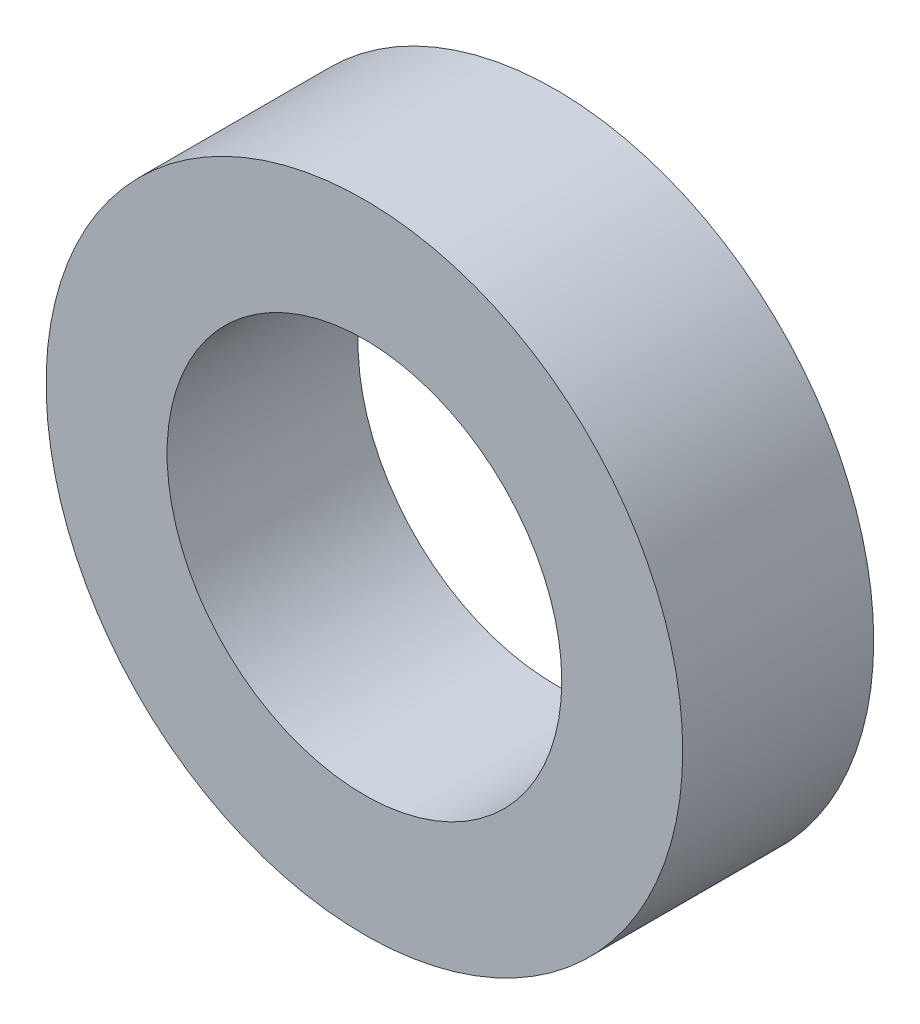
ISO-10303-21;
HEADER;
FILE_DESCRIPTION(('STEP AP214'),'2;1');
FILE_NAME('part.step','',(''),(''),'','','');
FILE_SCHEMA(('AUTOMOTIVE_DESIGN { 1 0 10303 214 1 1 1 1 }'));
ENDSEC;
DATA;
#1=APPLICATION_CONTEXT('core data for automotive mechanical design processes');
#2=APPLICATION_PROTOCOL_DEFINITION('international standard','automotive_design',2000,#1);
#3=PRODUCT_CONTEXT('',#1,'mechanical');
#4=PRODUCT('Part','Part','',(#3));
#5=PRODUCT_RELATED_PRODUCT_CATEGORY('part','',(#4));
#6=PRODUCT_DEFINITION_FORMATION('','',#4);
#7=PRODUCT_DEFINITION_CONTEXT('part definition',#1,'design');
#8=PRODUCT_DEFINITION('design','',#6,#7);
#9=PRODUCT_DEFINITION_SHAPE('','',#8);
#10=(LENGTH_UNIT() NAMED_UNIT(*) SI_UNIT(.MILLI.,.METRE.));
#11=(NAMED_UNIT(*) PLANE_ANGLE_UNIT() SI_UNIT($,.RADIAN.));
#12=(NAMED_UNIT(*) SI_UNIT($,.STERADIAN.) SOLID_ANGLE_UNIT());
#13=UNCERTAINTY_MEASURE_WITH_UNIT(LENGTH_MEASURE(1.E-05),#10,'distance_accuracy_value','');
#14=(GEOMETRIC_REPRESENTATION_CONTEXT(3) GLOBAL_UNCERTAINTY_ASSIGNED_CONTEXT((#13)) GLOBAL_UNIT_ASSIGNED_CONTEXT((#10,
#11,#12)) REPRESENTATION_CONTEXT('',''));
#15=CARTESIAN_POINT('',(0.,0.,0.));
#16=DIRECTION('',(0.,0.,1.));
#17=DIRECTION('',(1.,0.,0.));
#18=AXIS2_PLACEMENT_3D('',#15,#16,#17);
#19=CARTESIAN_POINT('',(0.,0.,3.));
#20=DIRECTION('',(0.,0.,1.));
#21=DIRECTION('',(1.,0.,0.));
#22=AXIS2_PLACEMENT_3D('',#19,#20,#21);
#23=PLANE('',#22);
#24=CARTESIAN_POINT('',(0.,0.,3.));
#25=DIRECTION('',(0.,0.,1.));
#26=DIRECTION('',(1.,0.,0.));
#27=AXIS2_PLACEMENT_3D('',#24,#25,#26);
#28=CIRCLE('',#27,5.);
#29=CARTESIAN_POINT('',(5.,0.,3.));
#30=VERTEX_POINT('',#29);
#31=EDGE_CURVE('E10',#30,#30,#28,.T.);
#32=ORIENTED_EDGE('',*,*,#31,.T.);
#33=EDGE_LOOP('',(#32));
#34=FACE_BOUND('',#33,.T.);
#35=CARTESIAN_POINT('',(0.,0.,3.));
#36=DIRECTION('',(0.,0.,1.));
#37=DIRECTION('',(1.,0.,0.));
#38=AXIS2_PLACEMENT_3D('',#35,#36,#37);
#39=CIRCLE('',#38,3.1);
#40=CARTESIAN_POINT('',(3.1,0.,3.));
#41=VERTEX_POINT('',#40);
#42=EDGE_CURVE('E50',#41,#41,#39,.T.);
#43=ORIENTED_EDGE('',*,*,#42,.F.);
#44=EDGE_LOOP('',(#43));
#45=FACE_BOUND('',#44,.T.);
#46=ADVANCED_FACE('F37',(#34,#45),#23,.T.);
#47=CARTESIAN_POINT('',(0.,0.,0.));
#48=DIRECTION('',(0.,0.,1.));
#49=DIRECTION('',(1.,0.,0.));
#50=AXIS2_PLACEMENT_3D('',#47,#48,#49);
#51=PLANE('',#50);
#52=CARTESIAN_POINT('',(0.,0.,0.));
#53=DIRECTION('',(0.,0.,1.));
#54=DIRECTION('',(1.,0.,0.));
#55=AXIS2_PLACEMENT_3D('',#52,#53,#54);
#56=CIRCLE('',#55,5.);
#57=CARTESIAN_POINT('',(5.,0.,0.));
#58=VERTEX_POINT('',#57);
#59=EDGE_CURVE('E41',#58,#58,#56,.T.);
#60=ORIENTED_EDGE('',*,*,#59,.F.);
#61=EDGE_LOOP('',(#60));
#62=FACE_BOUND('',#61,.T.);
#63=CARTESIAN_POINT('',(0.,0.,0.));
#64=DIRECTION('',(0.,0.,1.));
#65=DIRECTION('',(1.,0.,0.));
#66=AXIS2_PLACEMENT_3D('',#63,#64,#65);
#67=CIRCLE('',#66,3.1);
#68=CARTESIAN_POINT('',(3.1,0.,0.));
#69=VERTEX_POINT('',#68);
#70=EDGE_CURVE('E52',#69,#69,#67,.T.);
#71=ORIENTED_EDGE('',*,*,#70,.T.);
#72=EDGE_LOOP('',(#71));
#73=FACE_BOUND('',#72,.T.);
#74=ADVANCED_FACE('F64',(#62,#73),#51,.F.);
#75=CARTESIAN_POINT('',(0.,0.,3.));
#76=DIRECTION('',(0.,0.,-1.));
#77=DIRECTION('',(-1.,0.,0.));
#78=AXIS2_PLACEMENT_3D('',#75,#76,#77);
#79=CYLINDRICAL_SURFACE('',#78,5.);
#80=ORIENTED_EDGE('',*,*,#31,.F.);
#81=EDGE_LOOP('',(#80));
#82=FACE_BOUND('',#81,.T.);
#83=ORIENTED_EDGE('',*,*,#59,.T.);
#84=EDGE_LOOP('',(#83));
#85=FACE_BOUND('',#84,.T.);
#86=ADVANCED_FACE('F39',(#82,#85),#79,.T.);
#87=CARTESIAN_POINT('',(0.,0.,3.));
#88=DIRECTION('',(0.,0.,-1.));
#89=DIRECTION('',(-1.,0.,0.));
#90=AXIS2_PLACEMENT_3D('',#87,#88,#89);
#91=CYLINDRICAL_SURFACE('',#90,3.1);
#92=ORIENTED_EDGE('',*,*,#42,.T.);
#93=EDGE_LOOP('',(#92));
#94=FACE_BOUND('',#93,.T.);
#95=ORIENTED_EDGE('',*,*,#70,.F.);
#96=EDGE_LOOP('',(#95));
#97=FACE_BOUND('',#96,.T.);
#98=ADVANCED_FACE('F60',(#94,#97),#91,.F.);
#99=CLOSED_SHELL('',(#46,#74,#86,#98));
#100=MANIFOLD_SOLID_BREP('B2',#99);
#101=ADVANCED_BREP_SHAPE_REPRESENTATION('',(#18,#100),#14);
#102=SHAPE_DEFINITION_REPRESENTATION(#9,#101);
ENDSEC;
END-ISO-10303-21;
